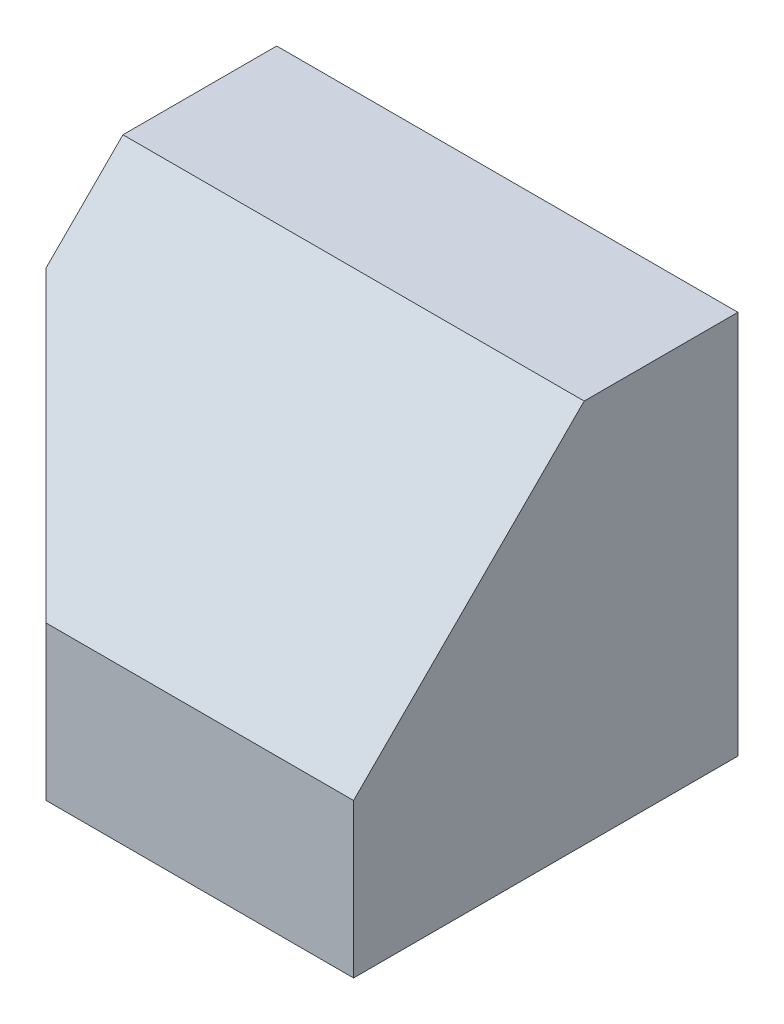
ISO-10303-21;
HEADER;
FILE_DESCRIPTION(('STEP AP214'),'2;1');
FILE_NAME('part.step','',(''),(''),'','','');
FILE_SCHEMA(('AUTOMOTIVE_DESIGN { 1 0 10303 214 1 1 1 1 }'));
ENDSEC;
DATA;
#1=APPLICATION_CONTEXT('core data for automotive mechanical design processes');
#2=APPLICATION_PROTOCOL_DEFINITION('international standard','automotive_design',2000,#1);
#3=PRODUCT_CONTEXT('',#1,'mechanical');
#4=PRODUCT('Part','Part','',(#3));
#5=PRODUCT_RELATED_PRODUCT_CATEGORY('part','',(#4));
#6=PRODUCT_DEFINITION_FORMATION('','',#4);
#7=PRODUCT_DEFINITION_CONTEXT('part definition',#1,'design');
#8=PRODUCT_DEFINITION('design','',#6,#7);
#9=PRODUCT_DEFINITION_SHAPE('','',#8);
#10=(LENGTH_UNIT() NAMED_UNIT(*) SI_UNIT(.MILLI.,.METRE.));
#11=(NAMED_UNIT(*) PLANE_ANGLE_UNIT() SI_UNIT($,.RADIAN.));
#12=(NAMED_UNIT(*) SI_UNIT($,.STERADIAN.) SOLID_ANGLE_UNIT());
#13=UNCERTAINTY_MEASURE_WITH_UNIT(LENGTH_MEASURE(1.E-05),#10,'distance_accuracy_value','');
#14=(GEOMETRIC_REPRESENTATION_CONTEXT(3) GLOBAL_UNCERTAINTY_ASSIGNED_CONTEXT((#13)) GLOBAL_UNIT_ASSIGNED_CONTEXT((#10,
#11,#12)) REPRESENTATION_CONTEXT('',''));
#15=CARTESIAN_POINT('',(0.,0.,0.));
#16=DIRECTION('',(0.,0.,1.));
#17=DIRECTION('',(1.,0.,0.));
#18=AXIS2_PLACEMENT_3D('',#15,#16,#17);
#19=CARTESIAN_POINT('',(0.,0.,50.));
#20=DIRECTION('',(1.,0.,0.));
#21=DIRECTION('',(0.,0.,-1.));
#22=AXIS2_PLACEMENT_3D('',#19,#20,#21);
#23=PLANE('',#22);
#24=DIRECTION('',(0.,-0.707106781186547,0.707106781186548));
#25=VECTOR('',#24,1.);
#26=CARTESIAN_POINT('',(0.,50.,20.));
#27=LINE('',#26,#25);
#28=CARTESIAN_POINT('',(0.,50.,20.));
#29=VERTEX_POINT('',#28);
#30=CARTESIAN_POINT('',(0.,40.,30.));
#31=VERTEX_POINT('',#30);
#32=EDGE_CURVE('E132',#29,#31,#27,.T.);
#33=ORIENTED_EDGE('',*,*,#32,.F.);
#34=DIRECTION('',(0.,0.,-1.));
#35=VECTOR('',#34,1.);
#36=CARTESIAN_POINT('',(0.,50.,50.));
#37=LINE('',#36,#35);
#38=CARTESIAN_POINT('',(0.,50.,0.));
#39=VERTEX_POINT('',#38);
#40=EDGE_CURVE('E94',#29,#39,#37,.T.);
#41=ORIENTED_EDGE('',*,*,#40,.T.);
#42=DIRECTION('',(0.,-1.,0.));
#43=VECTOR('',#42,1.);
#44=CARTESIAN_POINT('',(0.,0.,0.));
#45=LINE('',#44,#43);
#46=CARTESIAN_POINT('',(0.,0.,0.));
#47=VERTEX_POINT('',#46);
#48=EDGE_CURVE('E97',#39,#47,#45,.T.);
#49=ORIENTED_EDGE('',*,*,#48,.T.);
#50=DIRECTION('',(0.,0.,-1.));
#51=VECTOR('',#50,1.);
#52=CARTESIAN_POINT('',(0.,0.,50.));
#53=LINE('',#52,#51);
#54=CARTESIAN_POINT('',(0.,0.,30.));
#55=VERTEX_POINT('',#54);
#56=EDGE_CURVE('E11',#55,#47,#53,.T.);
#57=ORIENTED_EDGE('',*,*,#56,.F.);
#58=DIRECTION('',(0.,-1.,0.));
#59=VECTOR('',#58,1.);
#60=CARTESIAN_POINT('',(0.,50.,30.));
#61=LINE('',#60,#59);
#62=EDGE_CURVE('E117',#31,#55,#61,.T.);
#63=ORIENTED_EDGE('',*,*,#62,.F.);
#64=EDGE_LOOP('',(#33,#41,#49,#57,#63));
#65=FACE_BOUND('',#64,.T.);
#66=ADVANCED_FACE('F33',(#65),#23,.F.);
#67=CARTESIAN_POINT('',(0.,50.,50.));
#68=DIRECTION('',(0.,-1.,0.));
#69=DIRECTION('',(0.,0.,-1.));
#70=AXIS2_PLACEMENT_3D('',#67,#68,#69);
#71=PLANE('',#70);
#72=ORIENTED_EDGE('',*,*,#40,.F.);
#73=DIRECTION('',(-1.,0.,0.));
#74=VECTOR('',#73,1.);
#75=CARTESIAN_POINT('',(60.,50.,20.));
#76=LINE('',#75,#74);
#77=CARTESIAN_POINT('',(60.,50.,20.));
#78=VERTEX_POINT('',#77);
#79=EDGE_CURVE('E93',#78,#29,#76,.T.);
#80=ORIENTED_EDGE('',*,*,#79,.F.);
#81=DIRECTION('',(0.,0.,-1.));
#82=VECTOR('',#81,1.);
#83=CARTESIAN_POINT('',(60.,50.,50.));
#84=LINE('',#83,#82);
#85=CARTESIAN_POINT('',(60.,50.,0.));
#86=VERTEX_POINT('',#85);
#87=EDGE_CURVE('E76',#78,#86,#84,.T.);
#88=ORIENTED_EDGE('',*,*,#87,.T.);
#89=DIRECTION('',(-1.,0.,0.));
#90=VECTOR('',#89,1.);
#91=CARTESIAN_POINT('',(0.,50.,0.));
#92=LINE('',#91,#90);
#93=EDGE_CURVE('E83',#86,#39,#92,.T.);
#94=ORIENTED_EDGE('',*,*,#93,.T.);
#95=EDGE_LOOP('',(#72,#80,#88,#94));
#96=FACE_BOUND('',#95,.T.);
#97=ADVANCED_FACE('F90',(#96),#71,.F.);
#98=CARTESIAN_POINT('',(0.,50.,30.));
#99=DIRECTION('',(0.707106781186548,0.,-0.707106781186548));
#100=DIRECTION('',(-0.707106781186548,0.,-0.707106781186548));
#101=AXIS2_PLACEMENT_3D('',#98,#99,#100);
#102=PLANE('',#101);
#103=DIRECTION('',(0.577350269189626,-0.577350269189626,0.577350269189626));
#104=VECTOR('',#103,1.);
#105=CARTESIAN_POINT('',(-3.33333333333332,43.3333333333334,26.6666666666667));
#106=LINE('',#105,#104);
#107=CARTESIAN_POINT('',(20.,20.,50.));
#108=VERTEX_POINT('',#107);
#109=EDGE_CURVE('E125',#31,#108,#106,.T.);
#110=ORIENTED_EDGE('',*,*,#109,.F.);
#111=ORIENTED_EDGE('',*,*,#62,.T.);
#112=DIRECTION('',(0.707106781186548,0.,0.707106781186548));
#113=VECTOR('',#112,1.);
#114=CARTESIAN_POINT('',(0.,0.,30.));
#115=LINE('',#114,#113);
#116=CARTESIAN_POINT('',(20.,0.,50.));
#117=VERTEX_POINT('',#116);
#118=EDGE_CURVE('E113',#55,#117,#115,.T.);
#119=ORIENTED_EDGE('',*,*,#118,.T.);
#120=DIRECTION('',(0.,-1.,0.));
#121=VECTOR('',#120,1.);
#122=CARTESIAN_POINT('',(20.,50.,50.));
#123=LINE('',#122,#121);
#124=EDGE_CURVE('E47',#108,#117,#123,.T.);
#125=ORIENTED_EDGE('',*,*,#124,.F.);
#126=EDGE_LOOP('',(#110,#111,#119,#125));
#127=FACE_BOUND('',#126,.T.);
#128=ADVANCED_FACE('F142',(#127),#102,.F.);
#129=CARTESIAN_POINT('',(0.,35.,35.));
#130=DIRECTION('',(0.,0.707106781186548,0.707106781186548));
#131=DIRECTION('',(0.,-0.707106781186548,0.707106781186548));
#132=AXIS2_PLACEMENT_3D('',#129,#130,#131);
#133=PLANE('',#132);
#134=ORIENTED_EDGE('',*,*,#79,.T.);
#135=ORIENTED_EDGE('',*,*,#32,.T.);
#136=ORIENTED_EDGE('',*,*,#109,.T.);
#137=DIRECTION('',(1.,0.,0.));
#138=VECTOR('',#137,1.);
#139=CARTESIAN_POINT('',(60.,20.,50.));
#140=LINE('',#139,#138);
#141=CARTESIAN_POINT('',(60.,20.,50.));
#142=VERTEX_POINT('',#141);
#143=EDGE_CURVE('E134',#108,#142,#140,.T.);
#144=ORIENTED_EDGE('',*,*,#143,.T.);
#145=DIRECTION('',(0.,0.707106781186547,-0.707106781186547));
#146=VECTOR('',#145,1.);
#147=CARTESIAN_POINT('',(60.,20.,50.));
#148=LINE('',#147,#146);
#149=EDGE_CURVE('E133',#142,#78,#148,.T.);
#150=ORIENTED_EDGE('',*,*,#149,.T.);
#151=EDGE_LOOP('',(#134,#135,#136,#144,#150));
#152=FACE_BOUND('',#151,.T.);
#153=ADVANCED_FACE('F131',(#152),#133,.T.);
#154=CARTESIAN_POINT('',(60.,0.,50.));
#155=DIRECTION('',(-1.,0.,0.));
#156=DIRECTION('',(0.,0.,1.));
#157=AXIS2_PLACEMENT_3D('',#154,#155,#156);
#158=PLANE('',#157);
#159=DIRECTION('',(0.,0.,-1.));
#160=VECTOR('',#159,1.);
#161=CARTESIAN_POINT('',(60.,0.,50.));
#162=LINE('',#161,#160);
#163=CARTESIAN_POINT('',(60.,0.,50.));
#164=VERTEX_POINT('',#163);
#165=CARTESIAN_POINT('',(60.,0.,0.));
#166=VERTEX_POINT('',#165);
#167=EDGE_CURVE('E40',#164,#166,#162,.T.);
#168=ORIENTED_EDGE('',*,*,#167,.T.);
#169=DIRECTION('',(0.,1.,0.));
#170=VECTOR('',#169,1.);
#171=CARTESIAN_POINT('',(60.,0.,0.));
#172=LINE('',#171,#170);
#173=EDGE_CURVE('E71',#166,#86,#172,.T.);
#174=ORIENTED_EDGE('',*,*,#173,.T.);
#175=ORIENTED_EDGE('',*,*,#87,.F.);
#176=ORIENTED_EDGE('',*,*,#149,.F.);
#177=DIRECTION('',(0.,1.,0.));
#178=VECTOR('',#177,1.);
#179=CARTESIAN_POINT('',(60.,0.,50.));
#180=LINE('',#179,#178);
#181=EDGE_CURVE('E99',#164,#142,#180,.T.);
#182=ORIENTED_EDGE('',*,*,#181,.F.);
#183=EDGE_LOOP('',(#168,#174,#175,#176,#182));
#184=FACE_BOUND('',#183,.T.);
#185=ADVANCED_FACE('F73',(#184),#158,.F.);
#186=CARTESIAN_POINT('',(0.,0.,50.));
#187=DIRECTION('',(0.,1.,0.));
#188=DIRECTION('',(0.,0.,1.));
#189=AXIS2_PLACEMENT_3D('',#186,#187,#188);
#190=PLANE('',#189);
#191=ORIENTED_EDGE('',*,*,#118,.F.);
#192=ORIENTED_EDGE('',*,*,#56,.T.);
#193=DIRECTION('',(1.,0.,0.));
#194=VECTOR('',#193,1.);
#195=CARTESIAN_POINT('',(0.,0.,0.));
#196=LINE('',#195,#194);
#197=EDGE_CURVE('E84',#47,#166,#196,.T.);
#198=ORIENTED_EDGE('',*,*,#197,.T.);
#199=ORIENTED_EDGE('',*,*,#167,.F.);
#200=DIRECTION('',(1.,0.,0.));
#201=VECTOR('',#200,1.);
#202=CARTESIAN_POINT('',(0.,0.,50.));
#203=LINE('',#202,#201);
#204=EDGE_CURVE('E53',#117,#164,#203,.T.);
#205=ORIENTED_EDGE('',*,*,#204,.F.);
#206=EDGE_LOOP('',(#191,#192,#198,#199,#205));
#207=FACE_BOUND('',#206,.T.);
#208=ADVANCED_FACE('F111',(#207),#190,.F.);
#209=CARTESIAN_POINT('',(0.,0.,50.));
#210=DIRECTION('',(0.,0.,-1.));
#211=DIRECTION('',(-1.,0.,0.));
#212=AXIS2_PLACEMENT_3D('',#209,#210,#211);
#213=PLANE('',#212);
#214=ORIENTED_EDGE('',*,*,#181,.T.);
#215=ORIENTED_EDGE('',*,*,#143,.F.);
#216=ORIENTED_EDGE('',*,*,#124,.T.);
#217=ORIENTED_EDGE('',*,*,#204,.T.);
#218=EDGE_LOOP('',(#214,#215,#216,#217));
#219=FACE_BOUND('',#218,.T.);
#220=ADVANCED_FACE('F180',(#219),#213,.F.);
#221=CARTESIAN_POINT('',(0.,0.,0.));
#222=DIRECTION('',(0.,0.,-1.));
#223=DIRECTION('',(-1.,0.,0.));
#224=AXIS2_PLACEMENT_3D('',#221,#222,#223);
#225=PLANE('',#224);
#226=ORIENTED_EDGE('',*,*,#93,.F.);
#227=ORIENTED_EDGE('',*,*,#173,.F.);
#228=ORIENTED_EDGE('',*,*,#197,.F.);
#229=ORIENTED_EDGE('',*,*,#48,.F.);
#230=EDGE_LOOP('',(#226,#227,#228,#229));
#231=FACE_BOUND('',#230,.T.);
#232=ADVANCED_FACE('F96',(#231),#225,.T.);
#233=CLOSED_SHELL('',(#66,#97,#128,#153,#185,#208,#220,#232));
#234=MANIFOLD_SOLID_BREP('B2',#233);
#235=ADVANCED_BREP_SHAPE_REPRESENTATION('',(#18,#234),#14);
#236=SHAPE_DEFINITION_REPRESENTATION(#9,#235);
ENDSEC;
END-ISO-10303-21;
